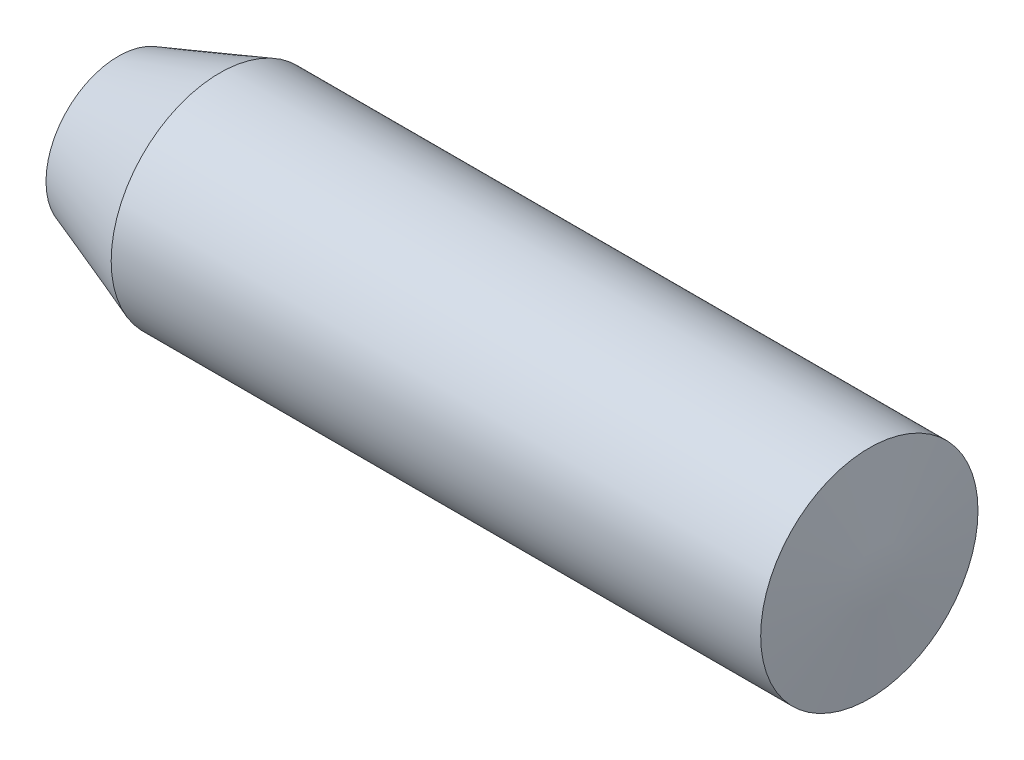
ISO-10303-21;
HEADER;
FILE_DESCRIPTION(('STEP AP214'),'2;1');
FILE_NAME('part.step','',(''),(''),'','','');
FILE_SCHEMA(('AUTOMOTIVE_DESIGN { 1 0 10303 214 1 1 1 1 }'));
ENDSEC;
DATA;
#1=APPLICATION_CONTEXT('core data for automotive mechanical design processes');
#2=APPLICATION_PROTOCOL_DEFINITION('international standard','automotive_design',2000,#1);
#3=PRODUCT_CONTEXT('',#1,'mechanical');
#4=PRODUCT('Part','Part','',(#3));
#5=PRODUCT_RELATED_PRODUCT_CATEGORY('part','',(#4));
#6=PRODUCT_DEFINITION_FORMATION('','',#4);
#7=PRODUCT_DEFINITION_CONTEXT('part definition',#1,'design');
#8=PRODUCT_DEFINITION('design','',#6,#7);
#9=PRODUCT_DEFINITION_SHAPE('','',#8);
#10=(LENGTH_UNIT() NAMED_UNIT(*) SI_UNIT(.MILLI.,.METRE.));
#11=(NAMED_UNIT(*) PLANE_ANGLE_UNIT() SI_UNIT($,.RADIAN.));
#12=(NAMED_UNIT(*) SI_UNIT($,.STERADIAN.) SOLID_ANGLE_UNIT());
#13=UNCERTAINTY_MEASURE_WITH_UNIT(LENGTH_MEASURE(1.E-05),#10,'distance_accuracy_value','');
#14=(GEOMETRIC_REPRESENTATION_CONTEXT(3) GLOBAL_UNCERTAINTY_ASSIGNED_CONTEXT((#13)) GLOBAL_UNIT_ASSIGNED_CONTEXT((#10,
#11,#12)) REPRESENTATION_CONTEXT('',''));
#15=CARTESIAN_POINT('',(0.,0.,0.));
#16=DIRECTION('',(0.,0.,1.));
#17=DIRECTION('',(1.,0.,0.));
#18=AXIS2_PLACEMENT_3D('',#15,#16,#17);
#19=CARTESIAN_POINT('',(1778.,0.,0.));
#20=DIRECTION('',(-1.,0.,0.));
#21=DIRECTION('',(0.,0.,1.));
#22=AXIS2_PLACEMENT_3D('',#19,#20,#21);
#23=CONICAL_SURFACE('',#22,0.,1.48247740137011);
#24=CARTESIAN_POINT('',(1755.50848282073,0.,0.));
#25=DIRECTION('',(-1.,0.,0.));
#26=DIRECTION('',(0.,0.,1.));
#27=AXIS2_PLACEMENT_3D('',#24,#25,#26);
#28=CIRCLE('',#27,254.);
#29=CARTESIAN_POINT('',(1755.50848282073,0.,254.));
#30=VERTEX_POINT('',#29);
#31=EDGE_CURVE('E11',#30,#30,#28,.T.);
#32=ORIENTED_EDGE('',*,*,#31,.F.);
#33=EDGE_LOOP('',(#32));
#34=FACE_BOUND('',#33,.T.);
#35=CARTESIAN_POINT('',(1778.,0.,0.));
#36=VERTEX_POINT('',#35);
#37=VERTEX_LOOP('',#36);
#38=FACE_BOUND('',#37,.T.);
#39=ADVANCED_FACE('F45',(#34,#38),#23,.T.);
#40=CARTESIAN_POINT('',(0.,0.,0.));
#41=DIRECTION('',(-1.,0.,0.));
#42=DIRECTION('',(0.,0.,1.));
#43=AXIS2_PLACEMENT_3D('',#40,#41,#42);
#44=CYLINDRICAL_SURFACE('',#43,254.);
#45=CARTESIAN_POINT('',(237.245718474749,0.,0.));
#46=DIRECTION('',(-1.,0.,0.));
#47=DIRECTION('',(0.,0.,1.));
#48=AXIS2_PLACEMENT_3D('',#45,#46,#47);
#49=CIRCLE('',#48,254.);
#50=CARTESIAN_POINT('',(237.245718474749,0.,254.));
#51=VERTEX_POINT('',#50);
#52=EDGE_CURVE('E52',#51,#51,#49,.T.);
#53=ORIENTED_EDGE('',*,*,#52,.F.);
#54=EDGE_LOOP('',(#53));
#55=FACE_BOUND('',#54,.T.);
#56=ORIENTED_EDGE('',*,*,#31,.T.);
#57=EDGE_LOOP('',(#56));
#58=FACE_BOUND('',#57,.T.);
#59=ADVANCED_FACE('F56',(#55,#58),#44,.T.);
#60=CARTESIAN_POINT('',(237.245718474749,0.,0.));
#61=DIRECTION('',(1.,0.,0.));
#62=DIRECTION('',(0.,0.,-1.));
#63=AXIS2_PLACEMENT_3D('',#60,#61,#62);
#64=CONICAL_SURFACE('',#63,254.,0.343668691405536);
#65=CARTESIAN_POINT('',(0.,0.,0.));
#66=DIRECTION('',(-1.,0.,0.));
#67=DIRECTION('',(0.,0.,1.));
#68=AXIS2_PLACEMENT_3D('',#65,#66,#67);
#69=CIRCLE('',#68,169.096871333114);
#70=CARTESIAN_POINT('',(0.,0.,169.096871333114));
#71=VERTEX_POINT('',#70);
#72=EDGE_CURVE('E79',#71,#71,#69,.T.);
#73=ORIENTED_EDGE('',*,*,#72,.F.);
#74=EDGE_LOOP('',(#73));
#75=FACE_BOUND('',#74,.T.);
#76=ORIENTED_EDGE('',*,*,#52,.T.);
#77=EDGE_LOOP('',(#76));
#78=FACE_BOUND('',#77,.T.);
#79=ADVANCED_FACE('F61',(#75,#78),#64,.T.);
#80=CARTESIAN_POINT('',(0.,0.,0.));
#81=DIRECTION('',(1.,0.,0.));
#82=DIRECTION('',(0.,0.,-1.));
#83=AXIS2_PLACEMENT_3D('',#80,#81,#82);
#84=PLANE('',#83);
#85=ORIENTED_EDGE('',*,*,#72,.T.);
#86=EDGE_LOOP('',(#85));
#87=FACE_BOUND('',#86,.T.);
#88=ADVANCED_FACE('F68',(#87),#84,.F.);
#89=CLOSED_SHELL('',(#39,#59,#79,#88));
#90=MANIFOLD_SOLID_BREP('B2',#89);
#91=ADVANCED_BREP_SHAPE_REPRESENTATION('',(#18,#90),#14);
#92=SHAPE_DEFINITION_REPRESENTATION(#9,#91);
ENDSEC;
END-ISO-10303-21;
